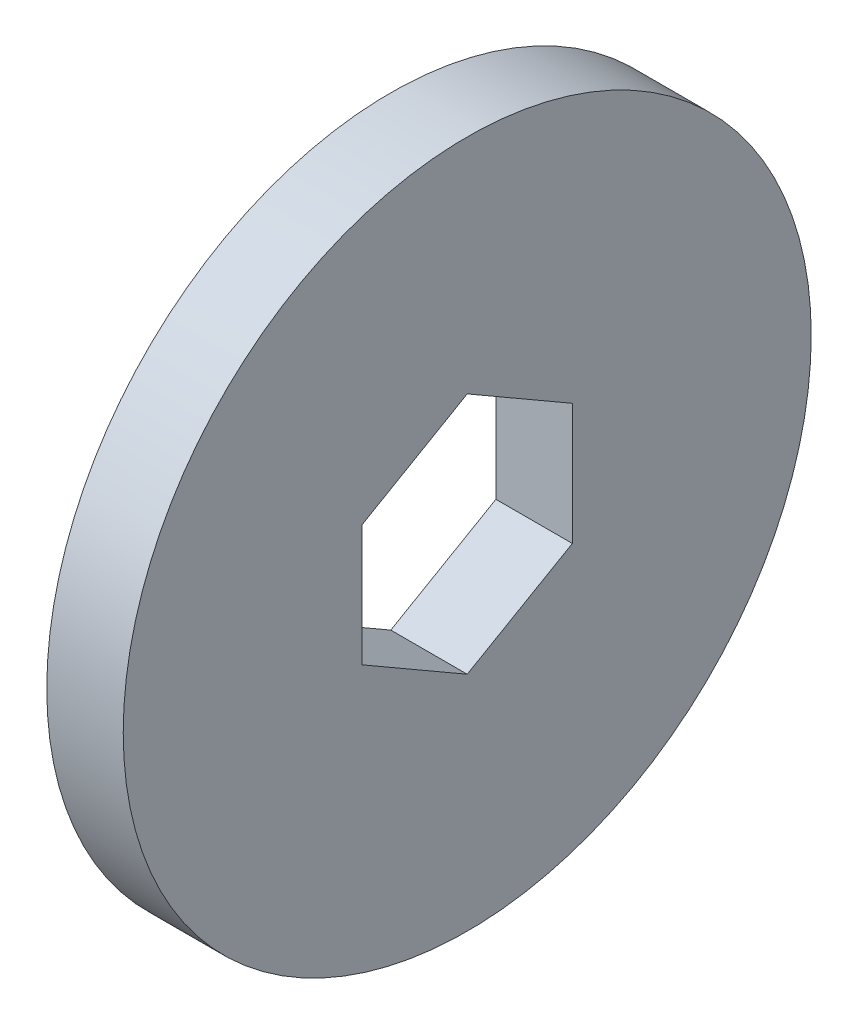
ISO-10303-21;
HEADER;
FILE_DESCRIPTION(('STEP AP214'),'2;1');
FILE_NAME('part.step','',(''),(''),'','','');
FILE_SCHEMA(('AUTOMOTIVE_DESIGN { 1 0 10303 214 1 1 1 1 }'));
ENDSEC;
DATA;
#1=APPLICATION_CONTEXT('core data for automotive mechanical design processes');
#2=APPLICATION_PROTOCOL_DEFINITION('international standard','automotive_design',2000,#1);
#3=PRODUCT_CONTEXT('',#1,'mechanical');
#4=PRODUCT('Part','Part','',(#3));
#5=PRODUCT_RELATED_PRODUCT_CATEGORY('part','',(#4));
#6=PRODUCT_DEFINITION_FORMATION('','',#4);
#7=PRODUCT_DEFINITION_CONTEXT('part definition',#1,'design');
#8=PRODUCT_DEFINITION('design','',#6,#7);
#9=PRODUCT_DEFINITION_SHAPE('','',#8);
#10=(LENGTH_UNIT() NAMED_UNIT(*) SI_UNIT(.MILLI.,.METRE.));
#11=(NAMED_UNIT(*) PLANE_ANGLE_UNIT() SI_UNIT($,.RADIAN.));
#12=(NAMED_UNIT(*) SI_UNIT($,.STERADIAN.) SOLID_ANGLE_UNIT());
#13=UNCERTAINTY_MEASURE_WITH_UNIT(LENGTH_MEASURE(1.E-05),#10,'distance_accuracy_value','');
#14=(GEOMETRIC_REPRESENTATION_CONTEXT(3) GLOBAL_UNCERTAINTY_ASSIGNED_CONTEXT((#13)) GLOBAL_UNIT_ASSIGNED_CONTEXT((#10,
#11,#12)) REPRESENTATION_CONTEXT('',''));
#15=CARTESIAN_POINT('',(0.,0.,0.));
#16=DIRECTION('',(0.,0.,1.));
#17=DIRECTION('',(1.,0.,0.));
#18=AXIS2_PLACEMENT_3D('',#15,#16,#17);
#19=CARTESIAN_POINT('',(2.,0.,0.));
#20=DIRECTION('',(-1.,0.,0.));
#21=DIRECTION('',(0.,0.,1.));
#22=AXIS2_PLACEMENT_3D('',#19,#20,#21);
#23=CYLINDRICAL_SURFACE('',#22,9.);
#24=CARTESIAN_POINT('',(2.,0.,0.));
#25=DIRECTION('',(1.,0.,0.));
#26=DIRECTION('',(0.,0.,-1.));
#27=AXIS2_PLACEMENT_3D('',#24,#25,#26);
#28=CIRCLE('',#27,9.);
#29=CARTESIAN_POINT('',(2.,0.,-9.));
#30=VERTEX_POINT('',#29);
#31=EDGE_CURVE('E11',#30,#30,#28,.T.);
#32=ORIENTED_EDGE('',*,*,#31,.F.);
#33=EDGE_LOOP('',(#32));
#34=FACE_BOUND('',#33,.T.);
#35=CARTESIAN_POINT('',(0.,0.,0.));
#36=DIRECTION('',(1.,0.,0.));
#37=DIRECTION('',(0.,0.,-1.));
#38=AXIS2_PLACEMENT_3D('',#35,#36,#37);
#39=CIRCLE('',#38,9.);
#40=CARTESIAN_POINT('',(0.,0.,-9.));
#41=VERTEX_POINT('',#40);
#42=EDGE_CURVE('E42',#41,#41,#39,.T.);
#43=ORIENTED_EDGE('',*,*,#42,.T.);
#44=EDGE_LOOP('',(#43));
#45=FACE_BOUND('',#44,.T.);
#46=ADVANCED_FACE('F39',(#34,#45),#23,.T.);
#47=CARTESIAN_POINT('',(2.,0.,0.));
#48=DIRECTION('',(1.,0.,0.));
#49=DIRECTION('',(0.,0.,-1.));
#50=AXIS2_PLACEMENT_3D('',#47,#48,#49);
#51=PLANE('',#50);
#52=DIRECTION('',(0.,0.5,0.866025403784439));
#53=VECTOR('',#52,1.);
#54=CARTESIAN_POINT('',(2.,1.58771324027147,-2.75));
#55=LINE('',#54,#53);
#56=CARTESIAN_POINT('',(2.,1.58771324027147,-2.75));
#57=VERTEX_POINT('',#56);
#58=CARTESIAN_POINT('',(2.,3.17542648054294,0.));
#59=VERTEX_POINT('',#58);
#60=EDGE_CURVE('E53',#57,#59,#55,.T.);
#61=ORIENTED_EDGE('',*,*,#60,.F.);
#62=DIRECTION('',(0.,1.,0.));
#63=VECTOR('',#62,1.);
#64=CARTESIAN_POINT('',(2.,-1.58771324027147,-2.75));
#65=LINE('',#64,#63);
#66=CARTESIAN_POINT('',(2.,-1.58771324027147,-2.75));
#67=VERTEX_POINT('',#66);
#68=EDGE_CURVE('E110',#67,#57,#65,.T.);
#69=ORIENTED_EDGE('',*,*,#68,.F.);
#70=DIRECTION('',(0.,0.5,-0.866025403784439));
#71=VECTOR('',#70,1.);
#72=CARTESIAN_POINT('',(2.,-3.17542648054294,0.));
#73=LINE('',#72,#71);
#74=CARTESIAN_POINT('',(2.,-3.17542648054294,0.));
#75=VERTEX_POINT('',#74);
#76=EDGE_CURVE('E113',#75,#67,#73,.T.);
#77=ORIENTED_EDGE('',*,*,#76,.F.);
#78=DIRECTION('',(0.,-0.5,-0.866025403784438));
#79=VECTOR('',#78,1.);
#80=CARTESIAN_POINT('',(2.,-1.58771324027147,2.75));
#81=LINE('',#80,#79);
#82=CARTESIAN_POINT('',(2.,-1.58771324027147,2.75));
#83=VERTEX_POINT('',#82);
#84=EDGE_CURVE('E129',#83,#75,#81,.T.);
#85=ORIENTED_EDGE('',*,*,#84,.F.);
#86=DIRECTION('',(0.,-1.,0.));
#87=VECTOR('',#86,1.);
#88=CARTESIAN_POINT('',(2.,1.58771324027147,2.75));
#89=LINE('',#88,#87);
#90=CARTESIAN_POINT('',(2.,1.58771324027147,2.75));
#91=VERTEX_POINT('',#90);
#92=EDGE_CURVE('E126',#91,#83,#89,.T.);
#93=ORIENTED_EDGE('',*,*,#92,.F.);
#94=DIRECTION('',(0.,-0.5,0.866025403784439));
#95=VECTOR('',#94,1.);
#96=CARTESIAN_POINT('',(2.,3.17542648054294,0.));
#97=LINE('',#96,#95);
#98=EDGE_CURVE('E124',#59,#91,#97,.T.);
#99=ORIENTED_EDGE('',*,*,#98,.F.);
#100=EDGE_LOOP('',(#61,#69,#77,#85,#93,#99));
#101=FACE_BOUND('',#100,.T.);
#102=ORIENTED_EDGE('',*,*,#31,.T.);
#103=EDGE_LOOP('',(#102));
#104=FACE_BOUND('',#103,.T.);
#105=ADVANCED_FACE('F146',(#101,#104),#51,.T.);
#106=CARTESIAN_POINT('',(0.,0.,0.));
#107=DIRECTION('',(1.,0.,0.));
#108=DIRECTION('',(0.,0.,-1.));
#109=AXIS2_PLACEMENT_3D('',#106,#107,#108);
#110=PLANE('',#109);
#111=DIRECTION('',(0.,1.,0.));
#112=VECTOR('',#111,1.);
#113=CARTESIAN_POINT('',(0.,-1.58771324027147,-2.75));
#114=LINE('',#113,#112);
#115=CARTESIAN_POINT('',(0.,-1.58771324027147,-2.75));
#116=VERTEX_POINT('',#115);
#117=CARTESIAN_POINT('',(0.,1.58771324027147,-2.75));
#118=VERTEX_POINT('',#117);
#119=EDGE_CURVE('E99',#116,#118,#114,.T.);
#120=ORIENTED_EDGE('',*,*,#119,.T.);
#121=DIRECTION('',(0.,0.5,0.866025403784439));
#122=VECTOR('',#121,1.);
#123=CARTESIAN_POINT('',(0.,1.58771324027147,-2.75));
#124=LINE('',#123,#122);
#125=CARTESIAN_POINT('',(0.,3.17542648054294,0.));
#126=VERTEX_POINT('',#125);
#127=EDGE_CURVE('E93',#118,#126,#124,.T.);
#128=ORIENTED_EDGE('',*,*,#127,.T.);
#129=DIRECTION('',(0.,-0.5,0.866025403784439));
#130=VECTOR('',#129,1.);
#131=CARTESIAN_POINT('',(0.,3.17542648054294,0.));
#132=LINE('',#131,#130);
#133=CARTESIAN_POINT('',(0.,1.58771324027147,2.75));
#134=VERTEX_POINT('',#133);
#135=EDGE_CURVE('E102',#126,#134,#132,.T.);
#136=ORIENTED_EDGE('',*,*,#135,.T.);
#137=DIRECTION('',(0.,-1.,0.));
#138=VECTOR('',#137,1.);
#139=CARTESIAN_POINT('',(0.,1.58771324027147,2.75));
#140=LINE('',#139,#138);
#141=CARTESIAN_POINT('',(0.,-1.58771324027147,2.75));
#142=VERTEX_POINT('',#141);
#143=EDGE_CURVE('E61',#134,#142,#140,.T.);
#144=ORIENTED_EDGE('',*,*,#143,.T.);
#145=DIRECTION('',(0.,-0.5,-0.866025403784438));
#146=VECTOR('',#145,1.);
#147=CARTESIAN_POINT('',(0.,-1.58771324027147,2.75));
#148=LINE('',#147,#146);
#149=CARTESIAN_POINT('',(0.,-3.17542648054294,0.));
#150=VERTEX_POINT('',#149);
#151=EDGE_CURVE('E117',#142,#150,#148,.T.);
#152=ORIENTED_EDGE('',*,*,#151,.T.);
#153=DIRECTION('',(0.,0.5,-0.866025403784439));
#154=VECTOR('',#153,1.);
#155=CARTESIAN_POINT('',(0.,-3.17542648054294,0.));
#156=LINE('',#155,#154);
#157=EDGE_CURVE('E120',#150,#116,#156,.T.);
#158=ORIENTED_EDGE('',*,*,#157,.T.);
#159=EDGE_LOOP('',(#120,#128,#136,#144,#152,#158));
#160=FACE_BOUND('',#159,.T.);
#161=ORIENTED_EDGE('',*,*,#42,.F.);
#162=EDGE_LOOP('',(#161));
#163=FACE_BOUND('',#162,.T.);
#164=ADVANCED_FACE('F106',(#160,#163),#110,.F.);
#165=CARTESIAN_POINT('',(0.,1.58771324027147,-2.75));
#166=DIRECTION('',(0.,0.866025403784439,-0.5));
#167=DIRECTION('',(0.,0.5,0.866025403784439));
#168=AXIS2_PLACEMENT_3D('',#165,#166,#167);
#169=PLANE('',#168);
#170=ORIENTED_EDGE('',*,*,#60,.T.);
#171=DIRECTION('',(1.,0.,0.));
#172=VECTOR('',#171,1.);
#173=CARTESIAN_POINT('',(0.,3.17542648054294,0.));
#174=LINE('',#173,#172);
#175=EDGE_CURVE('E89',#126,#59,#174,.T.);
#176=ORIENTED_EDGE('',*,*,#175,.F.);
#177=ORIENTED_EDGE('',*,*,#127,.F.);
#178=DIRECTION('',(1.,0.,0.));
#179=VECTOR('',#178,1.);
#180=CARTESIAN_POINT('',(0.,1.58771324027147,-2.75));
#181=LINE('',#180,#179);
#182=EDGE_CURVE('E134',#118,#57,#181,.T.);
#183=ORIENTED_EDGE('',*,*,#182,.T.);
#184=EDGE_LOOP('',(#170,#176,#177,#183));
#185=FACE_BOUND('',#184,.T.);
#186=ADVANCED_FACE('F91',(#185),#169,.F.);
#187=CARTESIAN_POINT('',(0.,-1.58771324027147,-2.75));
#188=DIRECTION('',(0.,0.,-1.));
#189=DIRECTION('',(0.,1.,0.));
#190=AXIS2_PLACEMENT_3D('',#187,#188,#189);
#191=PLANE('',#190);
#192=ORIENTED_EDGE('',*,*,#68,.T.);
#193=ORIENTED_EDGE('',*,*,#182,.F.);
#194=ORIENTED_EDGE('',*,*,#119,.F.);
#195=DIRECTION('',(1.,0.,0.));
#196=VECTOR('',#195,1.);
#197=CARTESIAN_POINT('',(0.,-1.58771324027147,-2.75));
#198=LINE('',#197,#196);
#199=EDGE_CURVE('E136',#116,#67,#198,.T.);
#200=ORIENTED_EDGE('',*,*,#199,.T.);
#201=EDGE_LOOP('',(#192,#193,#194,#200));
#202=FACE_BOUND('',#201,.T.);
#203=ADVANCED_FACE('F157',(#202),#191,.F.);
#204=CARTESIAN_POINT('',(0.,-3.17542648054294,0.));
#205=DIRECTION('',(0.,-0.866025403784439,-0.5));
#206=DIRECTION('',(0.,0.5,-0.866025403784439));
#207=AXIS2_PLACEMENT_3D('',#204,#205,#206);
#208=PLANE('',#207);
#209=ORIENTED_EDGE('',*,*,#76,.T.);
#210=ORIENTED_EDGE('',*,*,#199,.F.);
#211=ORIENTED_EDGE('',*,*,#157,.F.);
#212=DIRECTION('',(1.,0.,0.));
#213=VECTOR('',#212,1.);
#214=CARTESIAN_POINT('',(0.,-3.17542648054294,0.));
#215=LINE('',#214,#213);
#216=EDGE_CURVE('E138',#150,#75,#215,.T.);
#217=ORIENTED_EDGE('',*,*,#216,.T.);
#218=EDGE_LOOP('',(#209,#210,#211,#217));
#219=FACE_BOUND('',#218,.T.);
#220=ADVANCED_FACE('F155',(#219),#208,.F.);
#221=CARTESIAN_POINT('',(0.,-1.58771324027147,2.75));
#222=DIRECTION('',(0.,-0.866025403784439,0.5));
#223=DIRECTION('',(0.,-0.5,-0.866025403784439));
#224=AXIS2_PLACEMENT_3D('',#221,#222,#223);
#225=PLANE('',#224);
#226=ORIENTED_EDGE('',*,*,#84,.T.);
#227=ORIENTED_EDGE('',*,*,#216,.F.);
#228=ORIENTED_EDGE('',*,*,#151,.F.);
#229=DIRECTION('',(1.,0.,0.));
#230=VECTOR('',#229,1.);
#231=CARTESIAN_POINT('',(0.,-1.58771324027147,2.75));
#232=LINE('',#231,#230);
#233=EDGE_CURVE('E140',#142,#83,#232,.T.);
#234=ORIENTED_EDGE('',*,*,#233,.T.);
#235=EDGE_LOOP('',(#226,#227,#228,#234));
#236=FACE_BOUND('',#235,.T.);
#237=ADVANCED_FACE('F151',(#236),#225,.F.);
#238=CARTESIAN_POINT('',(0.,1.58771324027147,2.75));
#239=DIRECTION('',(0.,0.,1.));
#240=DIRECTION('',(1.,0.,0.));
#241=AXIS2_PLACEMENT_3D('',#238,#239,#240);
#242=PLANE('',#241);
#243=ORIENTED_EDGE('',*,*,#92,.T.);
#244=ORIENTED_EDGE('',*,*,#233,.F.);
#245=ORIENTED_EDGE('',*,*,#143,.F.);
#246=DIRECTION('',(1.,0.,0.));
#247=VECTOR('',#246,1.);
#248=CARTESIAN_POINT('',(0.,1.58771324027147,2.75));
#249=LINE('',#248,#247);
#250=EDGE_CURVE('E98',#134,#91,#249,.T.);
#251=ORIENTED_EDGE('',*,*,#250,.T.);
#252=EDGE_LOOP('',(#243,#244,#245,#251));
#253=FACE_BOUND('',#252,.T.);
#254=ADVANCED_FACE('F142',(#253),#242,.F.);
#255=CARTESIAN_POINT('',(0.,3.17542648054294,0.));
#256=DIRECTION('',(0.,0.866025403784439,0.5));
#257=DIRECTION('',(0.,-0.5,0.866025403784439));
#258=AXIS2_PLACEMENT_3D('',#255,#256,#257);
#259=PLANE('',#258);
#260=ORIENTED_EDGE('',*,*,#98,.T.);
#261=ORIENTED_EDGE('',*,*,#250,.F.);
#262=ORIENTED_EDGE('',*,*,#135,.F.);
#263=ORIENTED_EDGE('',*,*,#175,.T.);
#264=EDGE_LOOP('',(#260,#261,#262,#263));
#265=FACE_BOUND('',#264,.T.);
#266=ADVANCED_FACE('F103',(#265),#259,.F.);
#267=CLOSED_SHELL('',(#46,#105,#164,#186,#203,#220,#237,#254,#266));
#268=MANIFOLD_SOLID_BREP('B2',#267);
#269=ADVANCED_BREP_SHAPE_REPRESENTATION('',(#18,#268),#14);
#270=SHAPE_DEFINITION_REPRESENTATION(#9,#269);
ENDSEC;
END-ISO-10303-21;
